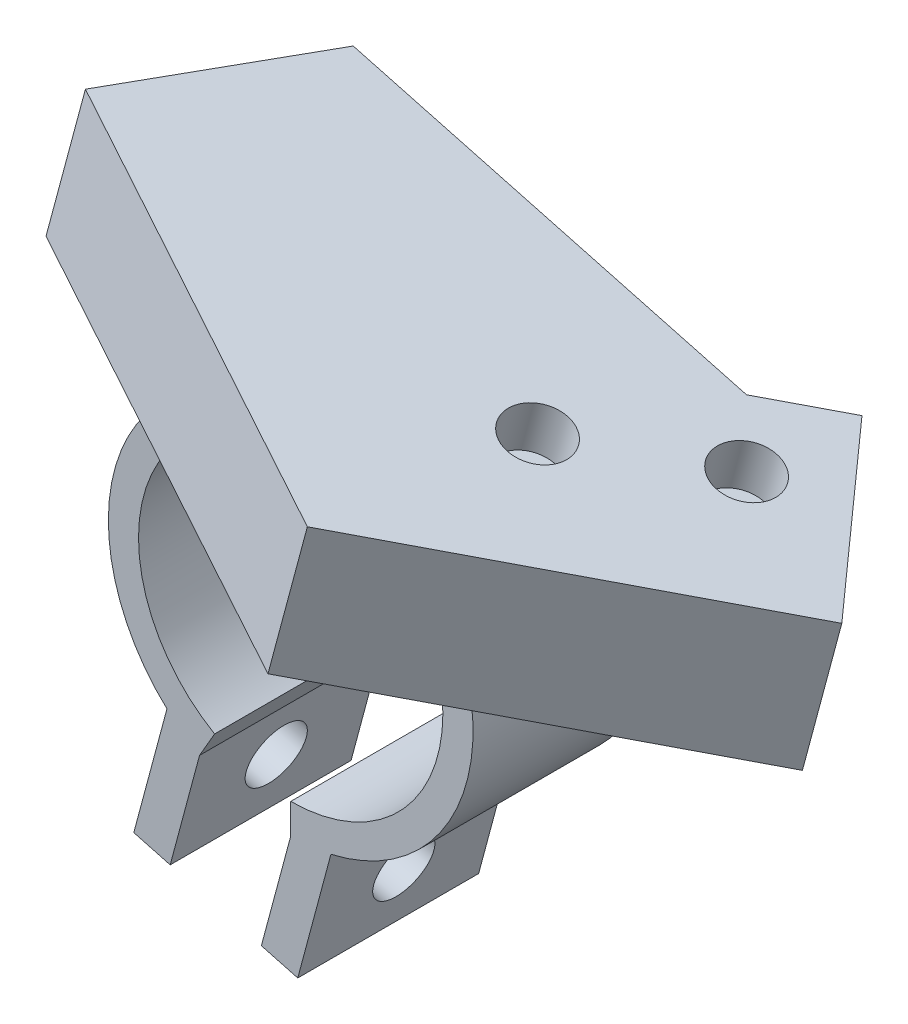
ISO-10303-21;
HEADER;
FILE_DESCRIPTION(('STEP AP214'),'2;1');
FILE_NAME('part.step','',(''),(''),'','','');
FILE_SCHEMA(('AUTOMOTIVE_DESIGN { 1 0 10303 214 1 1 1 1 }'));
ENDSEC;
DATA;
#1=APPLICATION_CONTEXT('core data for automotive mechanical design processes');
#2=APPLICATION_PROTOCOL_DEFINITION('international standard','automotive_design',2000,#1);
#3=PRODUCT_CONTEXT('',#1,'mechanical');
#4=PRODUCT('Part','Part','',(#3));
#5=PRODUCT_RELATED_PRODUCT_CATEGORY('part','',(#4));
#6=PRODUCT_DEFINITION_FORMATION('','',#4);
#7=PRODUCT_DEFINITION_CONTEXT('part definition',#1,'design');
#8=PRODUCT_DEFINITION('design','',#6,#7);
#9=PRODUCT_DEFINITION_SHAPE('','',#8);
#10=(LENGTH_UNIT() NAMED_UNIT(*) SI_UNIT(.MILLI.,.METRE.));
#11=(NAMED_UNIT(*) PLANE_ANGLE_UNIT() SI_UNIT($,.RADIAN.));
#12=(NAMED_UNIT(*) SI_UNIT($,.STERADIAN.) SOLID_ANGLE_UNIT());
#13=UNCERTAINTY_MEASURE_WITH_UNIT(LENGTH_MEASURE(1.E-05),#10,'distance_accuracy_value','');
#14=(GEOMETRIC_REPRESENTATION_CONTEXT(3) GLOBAL_UNCERTAINTY_ASSIGNED_CONTEXT((#13)) GLOBAL_UNIT_ASSIGNED_CONTEXT((#10,
#11,#12)) REPRESENTATION_CONTEXT('',''));
#15=CARTESIAN_POINT('',(0.,0.,0.));
#16=DIRECTION('',(0.,0.,1.));
#17=DIRECTION('',(1.,0.,0.));
#18=AXIS2_PLACEMENT_3D('',#15,#16,#17);
#19=CARTESIAN_POINT('',(0.,0.,0.));
#20=DIRECTION('',(0.,0.,1.));
#21=DIRECTION('',(1.,0.,0.));
#22=AXIS2_PLACEMENT_3D('',#19,#20,#21);
#23=PLANE('',#22);
#24=DIRECTION('',(0.965925826289069,-0.258819045102519,0.));
#25=VECTOR('',#24,1.);
#26=CARTESIAN_POINT('',(8.95474809949023,33.4195748762786,0.));
#27=LINE('',#26,#25);
#28=CARTESIAN_POINT('',(-17.386622384415,40.4777238249699,0.));
#29=VERTEX_POINT('',#28);
#30=CARTESIAN_POINT('',(34.8002931997711,26.4942819387162,0.));
#31=VERTEX_POINT('',#30);
#32=EDGE_CURVE('E226',#29,#31,#27,.T.);
#33=ORIENTED_EDGE('',*,*,#32,.F.);
#34=DIRECTION('',(-0.258819045102519,-0.965925826289069,0.));
#35=VECTOR('',#34,1.);
#36=CARTESIAN_POINT('',(-15.7042985912486,46.7562416958489,0.));
#37=LINE('',#36,#35);
#38=CARTESIAN_POINT('',(-15.7042985912486,46.7562416958489,0.));
#39=VERTEX_POINT('',#38);
#40=EDGE_CURVE('E290',#39,#29,#37,.T.);
#41=ORIENTED_EDGE('',*,*,#40,.F.);
#42=DIRECTION('',(0.965925826289069,-0.258819045102519,0.));
#43=VECTOR('',#42,1.);
#44=CARTESIAN_POINT('',(10.6370718926566,39.6980927471575,0.));
#45=LINE('',#44,#43);
#46=CARTESIAN_POINT('',(36.4826169929375,32.7727998095951,0.));
#47=VERTEX_POINT('',#46);
#48=EDGE_CURVE('E258',#39,#47,#45,.T.);
#49=ORIENTED_EDGE('',*,*,#48,.T.);
#50=DIRECTION('',(-0.258819045102519,-0.965925826289069,0.));
#51=VECTOR('',#50,1.);
#52=CARTESIAN_POINT('',(36.4826169929375,32.7727998095951,0.));
#53=LINE('',#52,#51);
#54=EDGE_CURVE('E286',#47,#31,#53,.T.);
#55=ORIENTED_EDGE('',*,*,#54,.T.);
#56=EDGE_LOOP('',(#33,#41,#49,#55));
#57=FACE_BOUND('',#56,.T.);
#58=ADVANCED_FACE('F38',(#57),#23,.F.);
#59=CARTESIAN_POINT('',(-11.8964203484179,45.7359237958064,-9.5898541144352));
#60=DIRECTION('',(0.893385391656228,-0.239381894224047,0.380208956618535));
#61=DIRECTION('',(0.391594370746934,0.,-0.920137950961329));
#62=AXIS2_PLACEMENT_3D('',#59,#60,#61);
#63=PLANE('',#62);
#64=DIRECTION('',(-0.367253650584263,0.098405319091434,0.924900615908026));
#65=VECTOR('',#64,1.);
#66=CARTESIAN_POINT('',(-13.5787441415843,39.4574059249274,-9.5898541144352));
#67=LINE('',#66,#65);
#68=CARTESIAN_POINT('',(-24.7316953961002,42.4458302067986,18.4980123181606));
#69=VERTEX_POINT('',#68);
#70=EDGE_CURVE('E453',#29,#69,#67,.T.);
#71=ORIENTED_EDGE('',*,*,#70,.T.);
#72=DIRECTION('',(-0.258819045102519,-0.965925826289069,0.));
#73=VECTOR('',#72,1.);
#74=CARTESIAN_POINT('',(-24.7316953961002,42.4458302067986,18.4980123181606));
#75=LINE('',#74,#73);
#76=CARTESIAN_POINT('',(-25.8963810990616,38.0991639884978,18.4980123181606));
#77=VERTEX_POINT('',#76);
#78=EDGE_CURVE('E224',#69,#77,#75,.T.);
#79=ORIENTED_EDGE('',*,*,#78,.T.);
#80=DIRECTION('',(-0.367253650584263,0.098405319091434,0.924900615908026));
#81=VECTOR('',#80,1.);
#82=CARTESIAN_POINT('',(-14.7434298445456,35.1107397066266,-9.5898541144352));
#83=LINE('',#82,#81);
#84=CARTESIAN_POINT('',(-18.5513080873763,36.1310576066691,0.));
#85=VERTEX_POINT('',#84);
#86=EDGE_CURVE('E432',#85,#77,#83,.T.);
#87=ORIENTED_EDGE('',*,*,#86,.F.);
#88=CARTESIAN_POINT('',(-20.9324433023195,27.2445400048097,0.));
#89=VERTEX_POINT('',#88);
#90=EDGE_CURVE('E276',#85,#89,#37,.T.);
#91=ORIENTED_EDGE('',*,*,#90,.T.);
#92=DIRECTION('',(-0.367253650584263,0.098405319091434,0.924900615908026));
#93=VECTOR('',#92,1.);
#94=CARTESIAN_POINT('',(-17.1245650594888,26.2242221047672,-9.58985411443521));
#95=LINE('',#94,#93);
#96=CARTESIAN_POINT('',(-31.0319186933868,29.9506862798241,25.4347669374709));
#97=VERTEX_POINT('',#96);
#98=EDGE_CURVE('E230',#89,#97,#95,.T.);
#99=ORIENTED_EDGE('',*,*,#98,.T.);
#100=DIRECTION('',(-0.258819045102519,-0.965925826289069,0.));
#101=VECTOR('',#100,1.);
#102=CARTESIAN_POINT('',(-25.8037739823159,49.4623879708633,25.4347669374709));
#103=LINE('',#102,#101);
#104=CARTESIAN_POINT('',(-25.8037739823159,49.4623879708633,25.4347669374709));
#105=VERTEX_POINT('',#104);
#106=EDGE_CURVE('E277',#105,#97,#103,.T.);
#107=ORIENTED_EDGE('',*,*,#106,.F.);
#108=DIRECTION('',(-0.367253650584263,0.098405319091434,0.924900615908026));
#109=VECTOR('',#108,1.);
#110=CARTESIAN_POINT('',(-11.8964203484179,45.7359237958064,-9.5898541144352));
#111=LINE('',#110,#109);
#112=EDGE_CURVE('E255',#39,#105,#111,.T.);
#113=ORIENTED_EDGE('',*,*,#112,.F.);
#114=ORIENTED_EDGE('',*,*,#40,.T.);
#115=EDGE_LOOP('',(#71,#79,#87,#91,#99,#107,#113,#114));
#116=FACE_BOUND('',#115,.T.);
#117=ADVANCED_FACE('F429',(#116),#63,.F.);
#118=CARTESIAN_POINT('',(32.852385511905,33.7455174032758,-20.691346675466));
#119=DIRECTION('',(-0.718087161401695,0.19241087499274,0.668826497542213));
#120=DIRECTION('',(0.681561853761521,0.,0.731760506926384));
#121=AXIS2_PLACEMENT_3D('',#118,#119,#120);
#122=PLANE('',#121);
#123=DIRECTION('',(-0.646036787282486,0.173105035433139,-0.743418533657465));
#124=VECTOR('',#123,1.);
#125=CARTESIAN_POINT('',(31.1700617187387,27.4669995323969,-20.691346675466));
#126=LINE('',#125,#124);
#127=CARTESIAN_POINT('',(55.6522563056765,20.9070152638853,7.48122423508143));
#128=VERTEX_POINT('',#127);
#129=CARTESIAN_POINT('',(42.7315205600268,24.369115972548,-7.38714643806784));
#130=VERTEX_POINT('',#129);
#131=EDGE_CURVE('E200',#128,#130,#126,.T.);
#132=ORIENTED_EDGE('',*,*,#131,.T.);
#133=DIRECTION('',(-0.258819045102519,-0.965925826289069,0.));
#134=VECTOR('',#133,1.);
#135=CARTESIAN_POINT('',(44.4138443531932,30.647633843427,-7.38714643806784));
#136=LINE('',#135,#134);
#137=CARTESIAN_POINT('',(44.4138443531932,30.647633843427,-7.38714643806784));
#138=VERTEX_POINT('',#137);
#139=EDGE_CURVE('E283',#138,#130,#136,.T.);
#140=ORIENTED_EDGE('',*,*,#139,.F.);
#141=DIRECTION('',(-0.646036787282486,0.173105035433139,-0.743418533657465));
#142=VECTOR('',#141,1.);
#143=CARTESIAN_POINT('',(32.852385511905,33.7455174032758,-20.691346675466));
#144=LINE('',#143,#142);
#145=CARTESIAN_POINT('',(62.1798560034617,25.8872453690156,13.0568632375122));
#146=VERTEX_POINT('',#145);
#147=EDGE_CURVE('E264',#146,#138,#144,.T.);
#148=ORIENTED_EDGE('',*,*,#147,.F.);
#149=DIRECTION('',(-0.258819045102519,-0.965925826289069,0.));
#150=VECTOR('',#149,1.);
#151=CARTESIAN_POINT('',(62.1798560034617,25.8872453690156,13.0568632375122));
#152=LINE('',#151,#150);
#153=CARTESIAN_POINT('',(56.9517112923908,6.37554367797645,13.0568632375122));
#154=VERTEX_POINT('',#153);
#155=EDGE_CURVE('E281',#146,#154,#152,.T.);
#156=ORIENTED_EDGE('',*,*,#155,.T.);
#157=DIRECTION('',(-0.646036787282486,0.173105035433139,-0.743418533657465));
#158=VECTOR('',#157,1.);
#159=CARTESIAN_POINT('',(27.6242408008341,14.2338157122366,-20.691346675466));
#160=LINE('',#159,#158);
#161=CARTESIAN_POINT('',(39.1856996421223,11.1359321523878,-7.38714643806785));
#162=VERTEX_POINT('',#161);
#163=EDGE_CURVE('E240',#154,#162,#160,.T.);
#164=ORIENTED_EDGE('',*,*,#163,.T.);
#165=CARTESIAN_POINT('',(41.5668348570655,20.0224497542472,-7.38714643806785));
#166=VERTEX_POINT('',#165);
#167=EDGE_CURVE('E285',#166,#162,#136,.T.);
#168=ORIENTED_EDGE('',*,*,#167,.F.);
#169=DIRECTION('',(-0.646036787282486,0.173105035433139,-0.743418533657465));
#170=VECTOR('',#169,1.);
#171=CARTESIAN_POINT('',(30.0053760157773,23.1203333140961,-20.691346675466));
#172=LINE('',#171,#170);
#173=CARTESIAN_POINT('',(54.4875706027152,16.5603490455845,7.48122423508142));
#174=VERTEX_POINT('',#173);
#175=EDGE_CURVE('E54',#174,#166,#172,.T.);
#176=ORIENTED_EDGE('',*,*,#175,.F.);
#177=DIRECTION('',(-0.258819045102519,-0.965925826289069,0.));
#178=VECTOR('',#177,1.);
#179=CARTESIAN_POINT('',(55.6522563056765,20.9070152638853,7.48122423508143));
#180=LINE('',#179,#178);
#181=EDGE_CURVE('E216',#128,#174,#180,.T.);
#182=ORIENTED_EDGE('',*,*,#181,.F.);
#183=EDGE_LOOP('',(#132,#140,#148,#156,#164,#168,#176,#182));
#184=FACE_BOUND('',#183,.T.);
#185=ADVANCED_FACE('F221',(#184),#122,.F.);
#186=CARTESIAN_POINT('',(22.1985307339448,36.6002091873087,13.3042002373981));
#187=DIRECTION('',(-0.646036787282486,0.173105035433139,-0.743418533657465));
#188=DIRECTION('',(-0.754813677044907,0.,0.655939260104125));
#189=AXIS2_PLACEMENT_3D('',#186,#187,#188);
#190=PLANE('',#189);
#191=ORIENTED_EDGE('',*,*,#139,.T.);
#192=DIRECTION('',(0.718087161401695,-0.19241087499274,-0.668826497542213));
#193=VECTOR('',#192,1.);
#194=CARTESIAN_POINT('',(20.5162069407784,30.3216913164297,13.3042002373981));
#195=LINE('',#194,#193);
#196=EDGE_CURVE('E206',#31,#130,#195,.T.);
#197=ORIENTED_EDGE('',*,*,#196,.F.);
#198=ORIENTED_EDGE('',*,*,#54,.F.);
#199=DIRECTION('',(0.718087161401695,-0.19241087499274,-0.668826497542213));
#200=VECTOR('',#199,1.);
#201=CARTESIAN_POINT('',(22.1985307339448,36.6002091873087,13.3042002373981));
#202=LINE('',#201,#200);
#203=EDGE_CURVE('E261',#47,#138,#202,.T.);
#204=ORIENTED_EDGE('',*,*,#203,.T.);
#205=EDGE_LOOP('',(#191,#197,#198,#204));
#206=FACE_BOUND('',#205,.T.);
#207=ADVANCED_FACE('F470',(#206),#190,.T.);
#208=CARTESIAN_POINT('',(29.0892210288191,34.7538542875041,20.3375832009133));
#209=DIRECTION('',(-0.258819045102519,-0.965925826289069,0.));
#210=DIRECTION('',(0.965925826289069,-0.258819045102519,0.));
#211=AXIS2_PLACEMENT_3D('',#208,#209,#210);
#212=CYLINDRICAL_SURFACE('',#211,4.);
#213=CARTESIAN_POINT('',(29.0892210288191,34.7538542875041,20.3375832009133));
#214=DIRECTION('',(-0.258819045102519,-0.965925826289069,0.));
#215=DIRECTION('',(0.965925826289069,-0.258819045102519,0.));
#216=AXIS2_PLACEMENT_3D('',#213,#214,#215);
#217=CIRCLE('',#216,4.);
#218=CARTESIAN_POINT('',(32.9529243339754,33.718578107094,20.3375832009133));
#219=VERTEX_POINT('',#218);
#220=EDGE_CURVE('E270',#219,#219,#217,.T.);
#221=ORIENTED_EDGE('',*,*,#220,.F.);
#222=EDGE_LOOP('',(#221));
#223=FACE_BOUND('',#222,.T.);
#224=CARTESIAN_POINT('',(27.4068972356528,28.4753364166251,20.3375832009133));
#225=DIRECTION('',(-0.258819045102519,-0.965925826289069,0.));
#226=DIRECTION('',(0.965925826289069,-0.258819045102519,0.));
#227=AXIS2_PLACEMENT_3D('',#224,#225,#226);
#228=CIRCLE('',#227,4.);
#229=CARTESIAN_POINT('',(31.270600540809,27.4400602362151,20.3375832009133));
#230=VERTEX_POINT('',#229);
#231=EDGE_CURVE('E443',#230,#230,#228,.T.);
#232=ORIENTED_EDGE('',*,*,#231,.T.);
#233=EDGE_LOOP('',(#232));
#234=FACE_BOUND('',#233,.T.);
#235=ADVANCED_FACE('F549',(#223,#234),#212,.F.);
#236=CARTESIAN_POINT('',(43.4509642568531,30.9056367876493,6.96105325006903));
#237=DIRECTION('',(-0.258819045102519,-0.965925826289069,0.));
#238=DIRECTION('',(0.965925826289069,-0.258819045102519,0.));
#239=AXIS2_PLACEMENT_3D('',#236,#237,#238);
#240=CYLINDRICAL_SURFACE('',#239,4.00000000000001);
#241=CARTESIAN_POINT('',(43.4509642568531,30.9056367876493,6.96105325006903));
#242=DIRECTION('',(-0.258819045102519,-0.965925826289069,0.));
#243=DIRECTION('',(0.965925826289069,-0.258819045102519,0.));
#244=AXIS2_PLACEMENT_3D('',#241,#242,#243);
#245=CIRCLE('',#244,4.00000000000001);
#246=CARTESIAN_POINT('',(47.3146675620093,29.8703606072392,6.96105325006903));
#247=VERTEX_POINT('',#246);
#248=EDGE_CURVE('E273',#247,#247,#245,.T.);
#249=ORIENTED_EDGE('',*,*,#248,.F.);
#250=EDGE_LOOP('',(#249));
#251=FACE_BOUND('',#250,.T.);
#252=CARTESIAN_POINT('',(41.7686404636867,24.6271189167704,6.96105325006903));
#253=DIRECTION('',(-0.258819045102519,-0.965925826289069,0.));
#254=DIRECTION('',(0.965925826289069,-0.258819045102519,0.));
#255=AXIS2_PLACEMENT_3D('',#252,#253,#254);
#256=CIRCLE('',#255,4.00000000000001);
#257=CARTESIAN_POINT('',(45.632343768843,23.5918427363603,6.96105325006903));
#258=VERTEX_POINT('',#257);
#259=EDGE_CURVE('E211',#258,#258,#256,.T.);
#260=ORIENTED_EDGE('',*,*,#259,.T.);
#261=EDGE_LOOP('',(#260));
#262=FACE_BOUND('',#261,.T.);
#263=ADVANCED_FACE('F553',(#251,#262),#240,.F.);
#264=CARTESIAN_POINT('',(0.,0.,24.));
#265=DIRECTION('',(0.,0.,-1.));
#266=DIRECTION('',(-1.,0.,0.));
#267=AXIS2_PLACEMENT_3D('',#264,#265,#266);
#268=CYLINDRICAL_SURFACE('',#267,24.193);
#269=CARTESIAN_POINT('',(0.,0.,24.));
#270=DIRECTION('',(0.,0.,1.));
#271=DIRECTION('',(1.,0.,0.));
#272=AXIS2_PLACEMENT_3D('',#269,#270,#271);
#273=CIRCLE('',#272,24.193);
#274=CARTESIAN_POINT('',(-6.36405527316415,23.3409521973743,24.));
#275=VERTEX_POINT('',#274);
#276=CARTESIAN_POINT('',(-16.419734670584,-17.7677675116381,24.));
#277=VERTEX_POINT('',#276);
#278=EDGE_CURVE('E376',#275,#277,#273,.T.);
#279=ORIENTED_EDGE('',*,*,#278,.F.);
#280=DIRECTION('',(0.,0.,-1.));
#281=VECTOR('',#280,1.);
#282=CARTESIAN_POINT('',(-6.36405527316415,23.3409521973743,24.));
#283=LINE('',#282,#281);
#284=CARTESIAN_POINT('',(-6.36405527316413,23.3409521973743,0.));
#285=VERTEX_POINT('',#284);
#286=EDGE_CURVE('E297',#275,#285,#283,.T.);
#287=ORIENTED_EDGE('',*,*,#286,.T.);
#288=CARTESIAN_POINT('',(0.,0.,0.));
#289=DIRECTION('',(0.,0.,1.));
#290=DIRECTION('',(1.,0.,0.));
#291=AXIS2_PLACEMENT_3D('',#288,#289,#290);
#292=CIRCLE('',#291,24.193);
#293=CARTESIAN_POINT('',(-16.419734670584,-17.7677675116381,0.));
#294=VERTEX_POINT('',#293);
#295=EDGE_CURVE('E371',#285,#294,#292,.T.);
#296=ORIENTED_EDGE('',*,*,#295,.T.);
#297=DIRECTION('',(0.,0.,1.));
#298=VECTOR('',#297,1.);
#299=CARTESIAN_POINT('',(-16.419734670584,-17.7677675116381,0.));
#300=LINE('',#299,#298);
#301=EDGE_CURVE('E343',#294,#277,#300,.T.);
#302=ORIENTED_EDGE('',*,*,#301,.T.);
#303=EDGE_LOOP('',(#279,#287,#296,#302));
#304=FACE_BOUND('',#303,.T.);
#305=ADVANCED_FACE('F416',(#304),#268,.T.);
#306=CARTESIAN_POINT('',(5.3360235923067,-23.5972053689064,0.));
#307=VERTEX_POINT('',#306);
#308=CARTESIAN_POINT('',(17.1819096363356,17.0318299148623,0.));
#309=VERTEX_POINT('',#308);
#310=EDGE_CURVE('E377',#307,#309,#292,.T.);
#311=ORIENTED_EDGE('',*,*,#310,.T.);
#312=DIRECTION('',(0.,0.,-1.));
#313=VECTOR('',#312,1.);
#314=CARTESIAN_POINT('',(17.1819096363356,17.0318299148623,24.));
#315=LINE('',#314,#313);
#316=CARTESIAN_POINT('',(17.1819096363356,17.0318299148623,24.));
#317=VERTEX_POINT('',#316);
#318=EDGE_CURVE('E294',#309,#317,#315,.F.);
#319=ORIENTED_EDGE('',*,*,#318,.T.);
#320=CARTESIAN_POINT('',(5.3360235923067,-23.5972053689064,24.));
#321=VERTEX_POINT('',#320);
#322=EDGE_CURVE('E374',#321,#317,#273,.T.);
#323=ORIENTED_EDGE('',*,*,#322,.F.);
#324=DIRECTION('',(0.,0.,1.));
#325=VECTOR('',#324,1.);
#326=CARTESIAN_POINT('',(5.3360235923067,-23.5972053689064,0.));
#327=LINE('',#326,#325);
#328=EDGE_CURVE('E321',#307,#321,#327,.T.);
#329=ORIENTED_EDGE('',*,*,#328,.F.);
#330=EDGE_LOOP('',(#311,#319,#323,#329));
#331=FACE_BOUND('',#330,.T.);
#332=ADVANCED_FACE('F40',(#331),#268,.T.);
#333=CARTESIAN_POINT('',(0.,0.,24.));
#334=DIRECTION('',(0.,0.,1.));
#335=DIRECTION('',(1.,0.,0.));
#336=AXIS2_PLACEMENT_3D('',#333,#334,#335);
#337=PLANE('',#336);
#338=DIRECTION('',(0.965925826289069,-0.258819045102519,0.));
#339=VECTOR('',#338,1.);
#340=CARTESIAN_POINT('',(5.40892718158571,20.1863910561183,24.));
#341=LINE('',#340,#339);
#342=EDGE_CURVE('E62',#275,#317,#341,.T.);
#343=ORIENTED_EDGE('',*,*,#342,.F.);
#344=ORIENTED_EDGE('',*,*,#278,.T.);
#345=DIRECTION('',(0.258819045102521,0.965925826289068,0.));
#346=VECTOR('',#345,1.);
#347=CARTESIAN_POINT('',(-10.8778791314454,2.91471892863415,24.));
#348=LINE('',#347,#346);
#349=CARTESIAN_POINT('',(-20.8196584373268,-34.1885065585523,24.));
#350=VERTEX_POINT('',#349);
#351=EDGE_CURVE('E323',#350,#277,#348,.T.);
#352=ORIENTED_EDGE('',*,*,#351,.F.);
#353=DIRECTION('',(-0.965925826289068,0.258819045102521,0.));
#354=VECTOR('',#353,1.);
#355=CARTESIAN_POINT('',(-9.94177930588146,-37.1032254871864,24.));
#356=LINE('',#355,#354);
#357=CARTESIAN_POINT('',(-15.9900293058815,-35.4826017840649,24.));
#358=VERTEX_POINT('',#357);
#359=EDGE_CURVE('E340',#358,#350,#356,.T.);
#360=ORIENTED_EDGE('',*,*,#359,.F.);
#361=DIRECTION('',(-0.258819045102521,-0.965925826289068,0.));
#362=VECTOR('',#361,1.);
#363=CARTESIAN_POINT('',(-6.04825000000001,1.62062370312154,24.));
#364=LINE('',#363,#362);
#365=CARTESIAN_POINT('',(-12.0965,-20.9517525937569,24.));
#366=VERTEX_POINT('',#365);
#367=EDGE_CURVE('E333',#366,#358,#364,.T.);
#368=ORIENTED_EDGE('',*,*,#367,.F.);
#369=DIRECTION('',(-0.500000000000001,-0.866025403784438,0.));
#370=VECTOR('',#369,1.);
#371=CARTESIAN_POINT('',(-12.0965,-20.9517525937569,24.));
#372=LINE('',#371,#370);
#373=CARTESIAN_POINT('',(-10.0965,-17.4876509786192,24.));
#374=VERTEX_POINT('',#373);
#375=EDGE_CURVE('E356',#374,#366,#372,.T.);
#376=ORIENTED_EDGE('',*,*,#375,.F.);
#377=CARTESIAN_POINT('',(0.,0.,24.));
#378=DIRECTION('',(0.,0.,1.));
#379=DIRECTION('',(1.,0.,0.));
#380=AXIS2_PLACEMENT_3D('',#377,#378,#379);
#381=CIRCLE('',#380,20.193);
#382=CARTESIAN_POINT('',(0.,-20.193,24.));
#383=VERTEX_POINT('',#382);
#384=EDGE_CURVE('E368',#383,#374,#381,.T.);
#385=ORIENTED_EDGE('',*,*,#384,.F.);
#386=DIRECTION('',(0.,1.,0.));
#387=VECTOR('',#386,1.);
#388=CARTESIAN_POINT('',(0.,-24.193,24.));
#389=LINE('',#388,#387);
#390=CARTESIAN_POINT('',(0.,-24.193,24.));
#391=VERTEX_POINT('',#390);
#392=EDGE_CURVE('E346',#391,#383,#389,.T.);
#393=ORIENTED_EDGE('',*,*,#392,.F.);
#394=DIRECTION('',(0.258819045102521,0.965925826289068,0.));
#395=VECTOR('',#394,1.);
#396=CARTESIAN_POINT('',(6.04825000000001,-1.62062370312154,24.));
#397=LINE('',#396,#395);
#398=CARTESIAN_POINT('',(-3.89352930588146,-38.723849190308,24.));
#399=VERTEX_POINT('',#398);
#400=EDGE_CURVE('E308',#399,#391,#397,.T.);
#401=ORIENTED_EDGE('',*,*,#400,.F.);
#402=DIRECTION('',(-0.965925826289068,0.258819045102521,0.));
#403=VECTOR('',#402,1.);
#404=CARTESIAN_POINT('',(-9.94177930588146,-37.1032254871864,24.));
#405=LINE('',#404,#403);
#406=CARTESIAN_POINT('',(0.93609982556388,-40.0179444158206,24.));
#407=VERTEX_POINT('',#406);
#408=EDGE_CURVE('E318',#407,#399,#405,.T.);
#409=ORIENTED_EDGE('',*,*,#408,.F.);
#410=DIRECTION('',(-0.258819045102521,-0.965925826289068,0.));
#411=VECTOR('',#410,1.);
#412=CARTESIAN_POINT('',(10.8778791314454,-2.91471892863415,24.));
#413=LINE('',#412,#411);
#414=EDGE_CURVE('E312',#321,#407,#413,.T.);
#415=ORIENTED_EDGE('',*,*,#414,.F.);
#416=ORIENTED_EDGE('',*,*,#322,.T.);
#417=EDGE_LOOP('',(#343,#344,#352,#360,#368,#376,#385,#393,#401,#409,#415,#416));
#418=FACE_BOUND('',#417,.T.);
#419=ADVANCED_FACE('F398',(#418),#337,.T.);
#420=ORIENTED_EDGE('',*,*,#90,.F.);
#421=DIRECTION('',(0.965925826289069,-0.258819045102519,0.));
#422=VECTOR('',#421,1.);
#423=CARTESIAN_POINT('',(7.79006239652889,29.0729086579777,0.));
#424=LINE('',#423,#422);
#425=CARTESIAN_POINT('',(33.6356074968098,22.1476157204154,0.));
#426=VERTEX_POINT('',#425);
#427=EDGE_CURVE('E424',#85,#426,#424,.T.);
#428=ORIENTED_EDGE('',*,*,#427,.T.);
#429=CARTESIAN_POINT('',(31.2544722818666,13.2610981185559,0.));
#430=VERTEX_POINT('',#429);
#431=EDGE_CURVE('E289',#426,#430,#53,.T.);
#432=ORIENTED_EDGE('',*,*,#431,.T.);
#433=DIRECTION('',(0.965925826289069,-0.258819045102519,0.));
#434=VECTOR('',#433,1.);
#435=CARTESIAN_POINT('',(5.40892718158571,20.1863910561183,0.));
#436=LINE('',#435,#434);
#437=EDGE_CURVE('E233',#309,#430,#436,.T.);
#438=ORIENTED_EDGE('',*,*,#437,.F.);
#439=ORIENTED_EDGE('',*,*,#310,.F.);
#440=DIRECTION('',(-0.258819045102521,-0.965925826289068,0.));
#441=VECTOR('',#440,1.);
#442=CARTESIAN_POINT('',(10.8778791314454,-2.91471892863415,0.));
#443=LINE('',#442,#441);
#444=CARTESIAN_POINT('',(0.93609982556388,-40.0179444158206,0.));
#445=VERTEX_POINT('',#444);
#446=EDGE_CURVE('E314',#307,#445,#443,.T.);
#447=ORIENTED_EDGE('',*,*,#446,.T.);
#448=DIRECTION('',(-0.965925826289068,0.258819045102521,0.));
#449=VECTOR('',#448,1.);
#450=CARTESIAN_POINT('',(-9.94177930588146,-37.1032254871864,0.));
#451=LINE('',#450,#449);
#452=CARTESIAN_POINT('',(-3.89352930588146,-38.723849190308,0.));
#453=VERTEX_POINT('',#452);
#454=EDGE_CURVE('E311',#445,#453,#451,.T.);
#455=ORIENTED_EDGE('',*,*,#454,.T.);
#456=DIRECTION('',(0.258819045102521,0.965925826289068,0.));
#457=VECTOR('',#456,1.);
#458=CARTESIAN_POINT('',(6.04825000000001,-1.62062370312154,0.));
#459=LINE('',#458,#457);
#460=CARTESIAN_POINT('',(0.,-24.193,0.));
#461=VERTEX_POINT('',#460);
#462=EDGE_CURVE('E309',#453,#461,#459,.T.);
#463=ORIENTED_EDGE('',*,*,#462,.T.);
#464=DIRECTION('',(0.,1.,0.));
#465=VECTOR('',#464,1.);
#466=CARTESIAN_POINT('',(0.,-24.193,0.));
#467=LINE('',#466,#465);
#468=CARTESIAN_POINT('',(0.,-20.193,0.));
#469=VERTEX_POINT('',#468);
#470=EDGE_CURVE('E352',#461,#469,#467,.T.);
#471=ORIENTED_EDGE('',*,*,#470,.T.);
#472=CARTESIAN_POINT('',(0.,0.,0.));
#473=DIRECTION('',(0.,0.,1.));
#474=DIRECTION('',(1.,0.,0.));
#475=AXIS2_PLACEMENT_3D('',#472,#473,#474);
#476=CIRCLE('',#475,20.193);
#477=CARTESIAN_POINT('',(-10.0965,-17.4876509786192,0.));
#478=VERTEX_POINT('',#477);
#479=EDGE_CURVE('E365',#469,#478,#476,.T.);
#480=ORIENTED_EDGE('',*,*,#479,.T.);
#481=DIRECTION('',(-0.500000000000001,-0.866025403784438,0.));
#482=VECTOR('',#481,1.);
#483=CARTESIAN_POINT('',(-12.0965,-20.9517525937569,0.));
#484=LINE('',#483,#482);
#485=CARTESIAN_POINT('',(-12.0965,-20.9517525937569,0.));
#486=VERTEX_POINT('',#485);
#487=EDGE_CURVE('E355',#478,#486,#484,.T.);
#488=ORIENTED_EDGE('',*,*,#487,.T.);
#489=DIRECTION('',(-0.258819045102521,-0.965925826289068,0.));
#490=VECTOR('',#489,1.);
#491=CARTESIAN_POINT('',(-6.04825000000001,1.62062370312154,0.));
#492=LINE('',#491,#490);
#493=CARTESIAN_POINT('',(-15.9900293058815,-35.4826017840649,0.));
#494=VERTEX_POINT('',#493);
#495=EDGE_CURVE('E335',#486,#494,#492,.T.);
#496=ORIENTED_EDGE('',*,*,#495,.T.);
#497=DIRECTION('',(-0.965925826289068,0.258819045102521,0.));
#498=VECTOR('',#497,1.);
#499=CARTESIAN_POINT('',(-9.94177930588146,-37.1032254871864,0.));
#500=LINE('',#499,#498);
#501=CARTESIAN_POINT('',(-20.8196584373268,-34.1885065585523,0.));
#502=VERTEX_POINT('',#501);
#503=EDGE_CURVE('E332',#494,#502,#500,.T.);
#504=ORIENTED_EDGE('',*,*,#503,.T.);
#505=DIRECTION('',(0.258819045102521,0.965925826289068,0.));
#506=VECTOR('',#505,1.);
#507=CARTESIAN_POINT('',(-10.8778791314454,2.91471892863415,0.));
#508=LINE('',#507,#506);
#509=EDGE_CURVE('E329',#502,#294,#508,.T.);
#510=ORIENTED_EDGE('',*,*,#509,.T.);
#511=ORIENTED_EDGE('',*,*,#295,.F.);
#512=EDGE_CURVE('E234',#89,#285,#436,.T.);
#513=ORIENTED_EDGE('',*,*,#512,.F.);
#514=EDGE_LOOP('',(#420,#428,#432,#438,#439,#447,#455,#463,#471,#480,#488,#496,#504,#510,#511,#513));
#515=FACE_BOUND('',#514,.T.);
#516=ADVANCED_FACE('F389',(#515),#23,.F.);
#517=CARTESIAN_POINT('',(0.,0.,24.));
#518=DIRECTION('',(0.,0.,-1.));
#519=DIRECTION('',(-1.,0.,0.));
#520=AXIS2_PLACEMENT_3D('',#517,#518,#519);
#521=CYLINDRICAL_SURFACE('',#520,20.193);
#522=DIRECTION('',(0.,0.,-1.));
#523=VECTOR('',#522,1.);
#524=CARTESIAN_POINT('',(-10.0965,-17.4876509786192,24.));
#525=LINE('',#524,#523);
#526=EDGE_CURVE('E11',#478,#374,#525,.F.);
#527=ORIENTED_EDGE('',*,*,#526,.F.);
#528=ORIENTED_EDGE('',*,*,#479,.F.);
#529=DIRECTION('',(0.,0.,-1.));
#530=VECTOR('',#529,1.);
#531=CARTESIAN_POINT('',(0.,-20.193,24.));
#532=LINE('',#531,#530);
#533=EDGE_CURVE('E47',#383,#469,#532,.T.);
#534=ORIENTED_EDGE('',*,*,#533,.F.);
#535=ORIENTED_EDGE('',*,*,#384,.T.);
#536=EDGE_LOOP('',(#527,#528,#534,#535));
#537=FACE_BOUND('',#536,.T.);
#538=ADVANCED_FACE('F393',(#537),#521,.F.);
#539=CARTESIAN_POINT('',(0.,-24.193,0.));
#540=DIRECTION('',(1.,0.,0.));
#541=DIRECTION('',(0.,0.,-1.));
#542=AXIS2_PLACEMENT_3D('',#539,#540,#541);
#543=PLANE('',#542);
#544=ORIENTED_EDGE('',*,*,#533,.T.);
#545=ORIENTED_EDGE('',*,*,#470,.F.);
#546=DIRECTION('',(0.,0.,1.));
#547=VECTOR('',#546,1.);
#548=CARTESIAN_POINT('',(0.,-24.193,0.));
#549=LINE('',#548,#547);
#550=EDGE_CURVE('E359',#461,#391,#549,.T.);
#551=ORIENTED_EDGE('',*,*,#550,.T.);
#552=ORIENTED_EDGE('',*,*,#392,.T.);
#553=EDGE_LOOP('',(#544,#545,#551,#552));
#554=FACE_BOUND('',#553,.T.);
#555=ADVANCED_FACE('F382',(#554),#543,.F.);
#556=CARTESIAN_POINT('',(-12.0965,-20.9517525937569,0.));
#557=DIRECTION('',(-0.866025403784438,0.500000000000001,0.));
#558=DIRECTION('',(-0.500000000000001,-0.866025403784438,0.));
#559=AXIS2_PLACEMENT_3D('',#556,#557,#558);
#560=PLANE('',#559);
#561=ORIENTED_EDGE('',*,*,#526,.T.);
#562=ORIENTED_EDGE('',*,*,#375,.T.);
#563=DIRECTION('',(0.,0.,1.));
#564=VECTOR('',#563,1.);
#565=CARTESIAN_POINT('',(-12.0965,-20.9517525937569,0.));
#566=LINE('',#565,#564);
#567=EDGE_CURVE('E362',#486,#366,#566,.T.);
#568=ORIENTED_EDGE('',*,*,#567,.F.);
#569=ORIENTED_EDGE('',*,*,#487,.F.);
#570=EDGE_LOOP('',(#561,#562,#568,#569));
#571=FACE_BOUND('',#570,.T.);
#572=ADVANCED_FACE('F396',(#571),#560,.F.);
#573=CARTESIAN_POINT('',(-10.8778791314454,2.91471892863415,0.));
#574=DIRECTION('',(0.965925826289068,-0.258819045102521,0.));
#575=DIRECTION('',(0.258819045102521,0.965925826289068,0.));
#576=AXIS2_PLACEMENT_3D('',#573,#574,#575);
#577=PLANE('',#576);
#578=CARTESIAN_POINT('',(-18.7491060765067,-26.4610999482397,12.));
#579=DIRECTION('',(-0.965925826289068,0.258819045102521,0.));
#580=DIRECTION('',(-0.258819045102521,-0.965925826289068,0.));
#581=AXIS2_PLACEMENT_3D('',#578,#579,#580);
#582=CIRCLE('',#581,4.);
#583=CARTESIAN_POINT('',(-19.7843822569167,-30.324803253396,12.));
#584=VERTEX_POINT('',#583);
#585=EDGE_CURVE('E299',#584,#584,#582,.T.);
#586=ORIENTED_EDGE('',*,*,#585,.F.);
#587=EDGE_LOOP('',(#586));
#588=FACE_BOUND('',#587,.T.);
#589=ORIENTED_EDGE('',*,*,#351,.T.);
#590=ORIENTED_EDGE('',*,*,#301,.F.);
#591=ORIENTED_EDGE('',*,*,#509,.F.);
#592=DIRECTION('',(0.,0.,1.));
#593=VECTOR('',#592,1.);
#594=CARTESIAN_POINT('',(-20.8196584373268,-34.1885065585523,0.));
#595=LINE('',#594,#593);
#596=EDGE_CURVE('E337',#502,#350,#595,.T.);
#597=ORIENTED_EDGE('',*,*,#596,.T.);
#598=EDGE_LOOP('',(#589,#590,#591,#597));
#599=FACE_BOUND('',#598,.T.);
#600=ADVANCED_FACE('F414',(#588,#599),#577,.F.);
#601=CARTESIAN_POINT('',(-6.04825000000001,1.62062370312154,0.));
#602=DIRECTION('',(-0.965925826289068,0.258819045102521,0.));
#603=DIRECTION('',(-0.258819045102521,-0.965925826289068,0.));
#604=AXIS2_PLACEMENT_3D('',#601,#602,#603);
#605=PLANE('',#604);
#606=CARTESIAN_POINT('',(-13.9194769450613,-27.7551951737523,12.));
#607=DIRECTION('',(-0.965925826289068,0.258819045102521,0.));
#608=DIRECTION('',(-0.258819045102521,-0.965925826289068,0.));
#609=AXIS2_PLACEMENT_3D('',#606,#607,#608);
#610=CIRCLE('',#609,4.);
#611=CARTESIAN_POINT('',(-14.9547531254714,-31.6188984789086,12.));
#612=VERTEX_POINT('',#611);
#613=EDGE_CURVE('E305',#612,#612,#610,.T.);
#614=ORIENTED_EDGE('',*,*,#613,.T.);
#615=EDGE_LOOP('',(#614));
#616=FACE_BOUND('',#615,.T.);
#617=ORIENTED_EDGE('',*,*,#367,.T.);
#618=DIRECTION('',(0.,0.,1.));
#619=VECTOR('',#618,1.);
#620=CARTESIAN_POINT('',(-15.9900293058815,-35.4826017840649,0.));
#621=LINE('',#620,#619);
#622=EDGE_CURVE('E347',#494,#358,#621,.T.);
#623=ORIENTED_EDGE('',*,*,#622,.F.);
#624=ORIENTED_EDGE('',*,*,#495,.F.);
#625=ORIENTED_EDGE('',*,*,#567,.T.);
#626=EDGE_LOOP('',(#617,#623,#624,#625));
#627=FACE_BOUND('',#626,.T.);
#628=ADVANCED_FACE('F403',(#616,#627),#605,.F.);
#629=CARTESIAN_POINT('',(-9.94177930588146,-37.1032254871864,0.));
#630=DIRECTION('',(0.258819045102521,0.965925826289068,0.));
#631=DIRECTION('',(-0.965925826289068,0.258819045102521,0.));
#632=AXIS2_PLACEMENT_3D('',#629,#630,#631);
#633=PLANE('',#632);
#634=ORIENTED_EDGE('',*,*,#359,.T.);
#635=ORIENTED_EDGE('',*,*,#596,.F.);
#636=ORIENTED_EDGE('',*,*,#503,.F.);
#637=ORIENTED_EDGE('',*,*,#622,.T.);
#638=EDGE_LOOP('',(#634,#635,#636,#637));
#639=FACE_BOUND('',#638,.T.);
#640=ADVANCED_FACE('F407',(#639),#633,.F.);
#641=CARTESIAN_POINT('',(6.04825000000001,-1.62062370312154,0.));
#642=DIRECTION('',(0.965925826289068,-0.258819045102521,0.));
#643=DIRECTION('',(0.258819045102521,0.965925826289068,0.));
#644=AXIS2_PLACEMENT_3D('',#641,#642,#643);
#645=PLANE('',#644);
#646=CARTESIAN_POINT('',(-1.82297694506129,-30.9964425799954,12.));
#647=DIRECTION('',(0.965925826289068,-0.258819045102521,0.));
#648=DIRECTION('',(0.258819045102521,0.965925826289068,0.));
#649=AXIS2_PLACEMENT_3D('',#646,#647,#648);
#650=CIRCLE('',#649,4.);
#651=CARTESIAN_POINT('',(-0.78770076465121,-27.1327392748392,12.));
#652=VERTEX_POINT('',#651);
#653=EDGE_CURVE('E302',#652,#652,#650,.T.);
#654=ORIENTED_EDGE('',*,*,#653,.T.);
#655=EDGE_LOOP('',(#654));
#656=FACE_BOUND('',#655,.T.);
#657=ORIENTED_EDGE('',*,*,#400,.T.);
#658=ORIENTED_EDGE('',*,*,#550,.F.);
#659=ORIENTED_EDGE('',*,*,#462,.F.);
#660=DIRECTION('',(0.,0.,1.));
#661=VECTOR('',#660,1.);
#662=CARTESIAN_POINT('',(-3.89352930588146,-38.723849190308,0.));
#663=LINE('',#662,#661);
#664=EDGE_CURVE('E316',#453,#399,#663,.T.);
#665=ORIENTED_EDGE('',*,*,#664,.T.);
#666=EDGE_LOOP('',(#657,#658,#659,#665));
#667=FACE_BOUND('',#666,.T.);
#668=ADVANCED_FACE('F523',(#656,#667),#645,.F.);
#669=CARTESIAN_POINT('',(10.8778791314454,-2.91471892863415,0.));
#670=DIRECTION('',(-0.965925826289068,0.258819045102521,0.));
#671=DIRECTION('',(-0.258819045102521,-0.965925826289068,0.));
#672=AXIS2_PLACEMENT_3D('',#669,#670,#671);
#673=PLANE('',#672);
#674=CARTESIAN_POINT('',(3.00665218638405,-32.290537805508,12.));
#675=DIRECTION('',(-0.965925826289068,0.258819045102521,0.));
#676=DIRECTION('',(-0.258819045102521,-0.965925826289068,0.));
#677=AXIS2_PLACEMENT_3D('',#674,#675,#676);
#678=CIRCLE('',#677,4.);
#679=CARTESIAN_POINT('',(1.97137600597396,-36.1542411106643,12.));
#680=VERTEX_POINT('',#679);
#681=EDGE_CURVE('E42',#680,#680,#678,.T.);
#682=ORIENTED_EDGE('',*,*,#681,.T.);
#683=EDGE_LOOP('',(#682));
#684=FACE_BOUND('',#683,.T.);
#685=ORIENTED_EDGE('',*,*,#414,.T.);
#686=DIRECTION('',(0.,0.,1.));
#687=VECTOR('',#686,1.);
#688=CARTESIAN_POINT('',(0.93609982556388,-40.0179444158206,0.));
#689=LINE('',#688,#687);
#690=EDGE_CURVE('E324',#445,#407,#689,.T.);
#691=ORIENTED_EDGE('',*,*,#690,.F.);
#692=ORIENTED_EDGE('',*,*,#446,.F.);
#693=ORIENTED_EDGE('',*,*,#328,.T.);
#694=EDGE_LOOP('',(#685,#691,#692,#693));
#695=FACE_BOUND('',#694,.T.);
#696=ADVANCED_FACE('F529',(#684,#695),#673,.F.);
#697=CARTESIAN_POINT('',(-9.94177930588146,-37.1032254871864,0.));
#698=DIRECTION('',(0.258819045102521,0.965925826289068,0.));
#699=DIRECTION('',(-0.965925826289068,0.258819045102521,0.));
#700=AXIS2_PLACEMENT_3D('',#697,#698,#699);
#701=PLANE('',#700);
#702=ORIENTED_EDGE('',*,*,#408,.T.);
#703=ORIENTED_EDGE('',*,*,#664,.F.);
#704=ORIENTED_EDGE('',*,*,#454,.F.);
#705=ORIENTED_EDGE('',*,*,#690,.T.);
#706=EDGE_LOOP('',(#702,#703,#704,#705));
#707=FACE_BOUND('',#706,.T.);
#708=ADVANCED_FACE('F531',(#707),#701,.F.);
#709=CARTESIAN_POINT('',(4.43311375443099,-32.6727570307003,12.));
#710=DIRECTION('',(-0.965925826289068,0.258819045102521,0.));
#711=DIRECTION('',(-0.258819045102521,-0.965925826289068,0.));
#712=AXIS2_PLACEMENT_3D('',#709,#710,#711);
#713=CYLINDRICAL_SURFACE('',#712,4.);
#714=ORIENTED_EDGE('',*,*,#681,.F.);
#715=EDGE_LOOP('',(#714));
#716=FACE_BOUND('',#715,.T.);
#717=ORIENTED_EDGE('',*,*,#653,.F.);
#718=EDGE_LOOP('',(#717));
#719=FACE_BOUND('',#718,.T.);
#720=ADVANCED_FACE('F534',(#716,#719),#713,.F.);
#721=ORIENTED_EDGE('',*,*,#585,.T.);
#722=EDGE_LOOP('',(#721));
#723=FACE_BOUND('',#722,.T.);
#724=ORIENTED_EDGE('',*,*,#613,.F.);
#725=EDGE_LOOP('',(#724));
#726=FACE_BOUND('',#725,.T.);
#727=ADVANCED_FACE('F493',(#723,#726),#713,.F.);
#728=CARTESIAN_POINT('',(5.40892718158571,20.1863910561183,0.));
#729=DIRECTION('',(-0.258819045102519,-0.965925826289069,0.));
#730=DIRECTION('',(0.965925826289069,-0.258819045102519,0.));
#731=AXIS2_PLACEMENT_3D('',#728,#729,#730);
#732=PLANE('',#731);
#733=CARTESIAN_POINT('',(38.2228195457822,11.3939350966101,6.96105325006902));
#734=DIRECTION('',(-0.258819045102519,-0.965925826289069,0.));
#735=DIRECTION('',(0.965925826289069,-0.258819045102519,0.));
#736=AXIS2_PLACEMENT_3D('',#733,#734,#735);
#737=CIRCLE('',#736,4.00000000000001);
#738=CARTESIAN_POINT('',(42.0865228509384,10.3586589162001,6.96105325006902));
#739=VERTEX_POINT('',#738);
#740=EDGE_CURVE('E252',#739,#739,#737,.T.);
#741=ORIENTED_EDGE('',*,*,#740,.F.);
#742=EDGE_LOOP('',(#741));
#743=FACE_BOUND('',#742,.T.);
#744=CARTESIAN_POINT('',(23.8610763177483,15.2421525964649,20.3375832009133));
#745=DIRECTION('',(-0.258819045102519,-0.965925826289069,0.));
#746=DIRECTION('',(0.965925826289069,-0.258819045102519,0.));
#747=AXIS2_PLACEMENT_3D('',#744,#745,#746);
#748=CIRCLE('',#747,4.);
#749=CARTESIAN_POINT('',(27.7247796229045,14.2068764160548,20.3375832009133));
#750=VERTEX_POINT('',#749);
#751=EDGE_CURVE('E249',#750,#750,#748,.T.);
#752=ORIENTED_EDGE('',*,*,#751,.F.);
#753=EDGE_LOOP('',(#752));
#754=FACE_BOUND('',#753,.T.);
#755=ORIENTED_EDGE('',*,*,#286,.F.);
#756=ORIENTED_EDGE('',*,*,#342,.T.);
#757=ORIENTED_EDGE('',*,*,#318,.F.);
#758=ORIENTED_EDGE('',*,*,#437,.T.);
#759=DIRECTION('',(0.718087161401695,-0.19241087499274,-0.668826497542213));
#760=VECTOR('',#759,1.);
#761=CARTESIAN_POINT('',(16.9703860228739,17.0885074962695,13.3042002373981));
#762=LINE('',#761,#760);
#763=EDGE_CURVE('E237',#430,#162,#762,.T.);
#764=ORIENTED_EDGE('',*,*,#763,.T.);
#765=ORIENTED_EDGE('',*,*,#163,.F.);
#766=DIRECTION('',(0.718087161401695,-0.19241087499274,-0.668826497542213));
#767=VECTOR('',#766,1.);
#768=CARTESIAN_POINT('',(34.7363976731422,12.3281190218582,33.7482099129784));
#769=LINE('',#768,#767);
#770=CARTESIAN_POINT('',(20.2362947680651,16.2134098854417,47.2536080892585));
#771=VERTEX_POINT('',#770);
#772=EDGE_CURVE('E243',#771,#154,#769,.T.);
#773=ORIENTED_EDGE('',*,*,#772,.F.);
#774=DIRECTION('',(0.893385391656228,-0.239381894224047,0.380208956618535));
#775=VECTOR('',#774,1.);
#776=CARTESIAN_POINT('',(-8.49842645231221,23.9128552311753,35.024621051906));
#777=LINE('',#776,#775);
#778=EDGE_CURVE('E246',#97,#771,#777,.T.);
#779=ORIENTED_EDGE('',*,*,#778,.F.);
#780=ORIENTED_EDGE('',*,*,#98,.F.);
#781=ORIENTED_EDGE('',*,*,#512,.T.);
#782=EDGE_LOOP('',(#755,#756,#757,#758,#764,#765,#773,#779,#780,#781));
#783=FACE_BOUND('',#782,.T.);
#784=ADVANCED_FACE('F419',(#743,#754,#783),#732,.T.);
#785=CARTESIAN_POINT('',(-3.27028174124132,43.4245569222145,35.024621051906));
#786=DIRECTION('',(0.367253650584263,-0.098405319091434,-0.924900615908025));
#787=DIRECTION('',(-0.929411591317328,0.,-0.369044839992366));
#788=AXIS2_PLACEMENT_3D('',#785,#786,#787);
#789=PLANE('',#788);
#790=ORIENTED_EDGE('',*,*,#106,.T.);
#791=ORIENTED_EDGE('',*,*,#778,.T.);
#792=DIRECTION('',(-0.258819045102519,-0.965925826289069,0.));
#793=VECTOR('',#792,1.);
#794=CARTESIAN_POINT('',(25.464439479136,35.7251115764809,47.2536080892585));
#795=LINE('',#794,#793);
#796=CARTESIAN_POINT('',(25.464439479136,35.7251115764809,47.2536080892585));
#797=VERTEX_POINT('',#796);
#798=EDGE_CURVE('E279',#797,#771,#795,.T.);
#799=ORIENTED_EDGE('',*,*,#798,.F.);
#800=DIRECTION('',(0.893385391656228,-0.239381894224047,0.380208956618535));
#801=VECTOR('',#800,1.);
#802=CARTESIAN_POINT('',(-3.27028174124132,43.4245569222145,35.024621051906));
#803=LINE('',#802,#801);
#804=EDGE_CURVE('E268',#105,#797,#803,.T.);
#805=ORIENTED_EDGE('',*,*,#804,.F.);
#806=EDGE_LOOP('',(#790,#791,#799,#805));
#807=FACE_BOUND('',#806,.T.);
#808=ADVANCED_FACE('F484',(#807),#789,.F.);
#809=CARTESIAN_POINT('',(39.9645423842131,31.8398207128974,33.7482099129784));
#810=DIRECTION('',(-0.646036787282486,0.173105035433139,-0.743418533657465));
#811=DIRECTION('',(-0.754813677044907,0.,0.655939260104125));
#812=AXIS2_PLACEMENT_3D('',#809,#810,#811);
#813=PLANE('',#812);
#814=ORIENTED_EDGE('',*,*,#798,.T.);
#815=ORIENTED_EDGE('',*,*,#772,.T.);
#816=ORIENTED_EDGE('',*,*,#155,.F.);
#817=DIRECTION('',(0.718087161401695,-0.19241087499274,-0.668826497542213));
#818=VECTOR('',#817,1.);
#819=CARTESIAN_POINT('',(39.9645423842131,31.8398207128974,33.7482099129784));
#820=LINE('',#819,#818);
#821=EDGE_CURVE('E266',#797,#146,#820,.T.);
#822=ORIENTED_EDGE('',*,*,#821,.F.);
#823=EDGE_LOOP('',(#814,#815,#816,#822));
#824=FACE_BOUND('',#823,.T.);
#825=ADVANCED_FACE('F481',(#824),#813,.F.);
#826=DIRECTION('',(0.718087161401695,-0.19241087499274,-0.668826497542213));
#827=VECTOR('',#826,1.);
#828=CARTESIAN_POINT('',(19.351521237817,25.9750250981289,13.3042002373981));
#829=LINE('',#828,#827);
#830=EDGE_CURVE('E437',#426,#166,#829,.T.);
#831=ORIENTED_EDGE('',*,*,#830,.T.);
#832=ORIENTED_EDGE('',*,*,#167,.T.);
#833=ORIENTED_EDGE('',*,*,#763,.F.);
#834=ORIENTED_EDGE('',*,*,#431,.F.);
#835=EDGE_LOOP('',(#831,#832,#833,#834));
#836=FACE_BOUND('',#835,.T.);
#837=ADVANCED_FACE('F491',(#836),#190,.T.);
#838=CARTESIAN_POINT('',(26.2422115326914,24.1286701983243,20.3375832009133));
#839=DIRECTION('',(-0.258819045102519,-0.965925826289069,0.));
#840=DIRECTION('',(0.965925826289069,-0.258819045102519,0.));
#841=AXIS2_PLACEMENT_3D('',#838,#839,#840);
#842=CIRCLE('',#841,4.);
#843=CARTESIAN_POINT('',(30.1059148378477,23.0933940179142,20.3375832009133));
#844=VERTEX_POINT('',#843);
#845=EDGE_CURVE('E456',#844,#844,#842,.T.);
#846=ORIENTED_EDGE('',*,*,#845,.F.);
#847=EDGE_LOOP('',(#846));
#848=FACE_BOUND('',#847,.T.);
#849=ORIENTED_EDGE('',*,*,#751,.T.);
#850=EDGE_LOOP('',(#849));
#851=FACE_BOUND('',#850,.T.);
#852=ADVANCED_FACE('F544',(#848,#851),#212,.F.);
#853=CARTESIAN_POINT('',(40.6039547607253,20.2804526984696,6.96105325006903));
#854=DIRECTION('',(-0.258819045102519,-0.965925826289069,0.));
#855=DIRECTION('',(0.965925826289069,-0.258819045102519,0.));
#856=AXIS2_PLACEMENT_3D('',#853,#854,#855);
#857=CIRCLE('',#856,4.00000000000001);
#858=CARTESIAN_POINT('',(44.4676580658816,19.2451765180595,6.96105325006903));
#859=VERTEX_POINT('',#858);
#860=EDGE_CURVE('E459',#859,#859,#857,.T.);
#861=ORIENTED_EDGE('',*,*,#860,.F.);
#862=EDGE_LOOP('',(#861));
#863=FACE_BOUND('',#862,.T.);
#864=ORIENTED_EDGE('',*,*,#740,.T.);
#865=EDGE_LOOP('',(#864));
#866=FACE_BOUND('',#865,.T.);
#867=ADVANCED_FACE('F560',(#863,#866),#240,.F.);
#868=CARTESIAN_POINT('',(10.6370718926566,39.6980927471575,0.));
#869=DIRECTION('',(-0.258819045102519,-0.965925826289069,0.));
#870=DIRECTION('',(0.965925826289069,-0.258819045102519,0.));
#871=AXIS2_PLACEMENT_3D('',#868,#869,#870);
#872=PLANE('',#871);
#873=ORIENTED_EDGE('',*,*,#112,.T.);
#874=ORIENTED_EDGE('',*,*,#804,.T.);
#875=ORIENTED_EDGE('',*,*,#821,.T.);
#876=ORIENTED_EDGE('',*,*,#147,.T.);
#877=ORIENTED_EDGE('',*,*,#203,.F.);
#878=ORIENTED_EDGE('',*,*,#48,.F.);
#879=EDGE_LOOP('',(#873,#874,#875,#876,#877,#878));
#880=FACE_BOUND('',#879,.T.);
#881=ORIENTED_EDGE('',*,*,#220,.T.);
#882=EDGE_LOOP('',(#881));
#883=FACE_BOUND('',#882,.T.);
#884=ORIENTED_EDGE('',*,*,#248,.T.);
#885=EDGE_LOOP('',(#884));
#886=FACE_BOUND('',#885,.T.);
#887=ADVANCED_FACE('F476',(#880,#883,#886),#872,.F.);
#888=CARTESIAN_POINT('',(-2.19820315502572,36.4079991581497,28.0878664325958));
#889=DIRECTION('',(-0.367253650584263,0.098405319091434,0.924900615908026));
#890=DIRECTION('',(0.929411591317328,0.,0.369044839992366));
#891=AXIS2_PLACEMENT_3D('',#888,#889,#890);
#892=PLANE('',#891);
#893=DIRECTION('',(-0.893385391656228,0.239381894224047,-0.380208956618535));
#894=VECTOR('',#893,1.);
#895=CARTESIAN_POINT('',(-3.36288885798706,32.0613329398489,28.0878664325958));
#896=LINE('',#895,#894);
#897=CARTESIAN_POINT('',(21.158641422632,25.4908087039818,38.5237942301163));
#898=VERTEX_POINT('',#897);
#899=EDGE_CURVE('E435',#898,#77,#896,.T.);
#900=ORIENTED_EDGE('',*,*,#899,.T.);
#901=ORIENTED_EDGE('',*,*,#78,.F.);
#902=DIRECTION('',(-0.893385391656228,0.239381894224047,-0.380208956618535));
#903=VECTOR('',#902,1.);
#904=CARTESIAN_POINT('',(-2.19820315502572,36.4079991581497,28.0878664325958));
#905=LINE('',#904,#903);
#906=CARTESIAN_POINT('',(22.3233271255933,29.8374749222826,38.5237942301163));
#907=VERTEX_POINT('',#906);
#908=EDGE_CURVE('E219',#907,#69,#905,.T.);
#909=ORIENTED_EDGE('',*,*,#908,.F.);
#910=DIRECTION('',(-0.258819045102519,-0.965925826289069,0.));
#911=VECTOR('',#910,1.);
#912=CARTESIAN_POINT('',(22.3233271255933,29.8374749222826,38.5237942301163));
#913=LINE('',#912,#911);
#914=EDGE_CURVE('E217',#907,#898,#913,.T.);
#915=ORIENTED_EDGE('',*,*,#914,.T.);
#916=EDGE_LOOP('',(#900,#901,#909,#915));
#917=FACE_BOUND('',#916,.T.);
#918=ADVANCED_FACE('F464',(#917),#892,.F.);
#919=CARTESIAN_POINT('',(33.4369426864281,26.859590607767,28.1725709105474));
#920=DIRECTION('',(0.646036787282486,-0.173105035433139,0.743418533657465));
#921=DIRECTION('',(0.754813677044907,0.,-0.655939260104125));
#922=AXIS2_PLACEMENT_3D('',#919,#920,#921);
#923=PLANE('',#922);
#924=DIRECTION('',(-0.718087161401695,0.19241087499274,0.668826497542213));
#925=VECTOR('',#924,1.);
#926=CARTESIAN_POINT('',(32.2722569834667,22.5129243894662,28.1725709105474));
#927=LINE('',#926,#925);
#928=EDGE_CURVE('E439',#174,#898,#927,.T.);
#929=ORIENTED_EDGE('',*,*,#928,.T.);
#930=ORIENTED_EDGE('',*,*,#914,.F.);
#931=DIRECTION('',(-0.718087161401695,0.19241087499274,0.668826497542213));
#932=VECTOR('',#931,1.);
#933=CARTESIAN_POINT('',(33.4369426864281,26.859590607767,28.1725709105474));
#934=LINE('',#933,#932);
#935=EDGE_CURVE('E204',#128,#907,#934,.T.);
#936=ORIENTED_EDGE('',*,*,#935,.F.);
#937=ORIENTED_EDGE('',*,*,#181,.T.);
#938=EDGE_LOOP('',(#929,#930,#936,#937));
#939=FACE_BOUND('',#938,.T.);
#940=ADVANCED_FACE('F215',(#939),#923,.F.);
#941=CARTESIAN_POINT('',(8.95474809949023,33.4195748762786,0.));
#942=DIRECTION('',(-0.258819045102519,-0.965925826289069,0.));
#943=DIRECTION('',(0.965925826289069,-0.258819045102519,0.));
#944=AXIS2_PLACEMENT_3D('',#941,#942,#943);
#945=PLANE('',#944);
#946=ORIENTED_EDGE('',*,*,#231,.F.);
#947=EDGE_LOOP('',(#946));
#948=FACE_BOUND('',#947,.T.);
#949=ORIENTED_EDGE('',*,*,#259,.F.);
#950=EDGE_LOOP('',(#949));
#951=FACE_BOUND('',#950,.T.);
#952=ORIENTED_EDGE('',*,*,#131,.F.);
#953=ORIENTED_EDGE('',*,*,#935,.T.);
#954=ORIENTED_EDGE('',*,*,#908,.T.);
#955=ORIENTED_EDGE('',*,*,#70,.F.);
#956=ORIENTED_EDGE('',*,*,#32,.T.);
#957=ORIENTED_EDGE('',*,*,#196,.T.);
#958=EDGE_LOOP('',(#952,#953,#954,#955,#956,#957));
#959=FACE_BOUND('',#958,.T.);
#960=ADVANCED_FACE('F202',(#948,#951,#959),#945,.T.);
#961=CARTESIAN_POINT('',(7.79006239652889,29.0729086579777,0.));
#962=DIRECTION('',(-0.258819045102519,-0.965925826289069,0.));
#963=DIRECTION('',(0.965925826289069,-0.258819045102519,0.));
#964=AXIS2_PLACEMENT_3D('',#961,#962,#963);
#965=PLANE('',#964);
#966=ORIENTED_EDGE('',*,*,#845,.T.);
#967=EDGE_LOOP('',(#966));
#968=FACE_BOUND('',#967,.T.);
#969=ORIENTED_EDGE('',*,*,#860,.T.);
#970=EDGE_LOOP('',(#969));
#971=FACE_BOUND('',#970,.T.);
#972=ORIENTED_EDGE('',*,*,#175,.T.);
#973=ORIENTED_EDGE('',*,*,#830,.F.);
#974=ORIENTED_EDGE('',*,*,#427,.F.);
#975=ORIENTED_EDGE('',*,*,#86,.T.);
#976=ORIENTED_EDGE('',*,*,#899,.F.);
#977=ORIENTED_EDGE('',*,*,#928,.F.);
#978=EDGE_LOOP('',(#972,#973,#974,#975,#976,#977));
#979=FACE_BOUND('',#978,.T.);
#980=ADVANCED_FACE('F462',(#968,#971,#979),#965,.F.);
#981=CLOSED_SHELL('',(#58,#117,#185,#207,#235,#263,#305,#332,#419,#516,#538,#555,#572,#600,#628,
#640,#668,#696,#708,#720,#727,#784,#808,#825,#837,#852,#867,#887,#918,#940,#960,#980));
#982=MANIFOLD_SOLID_BREP('B2',#981);
#983=ADVANCED_BREP_SHAPE_REPRESENTATION('',(#18,#982),#14);
#984=SHAPE_DEFINITION_REPRESENTATION(#9,#983);
ENDSEC;
END-ISO-10303-21;
